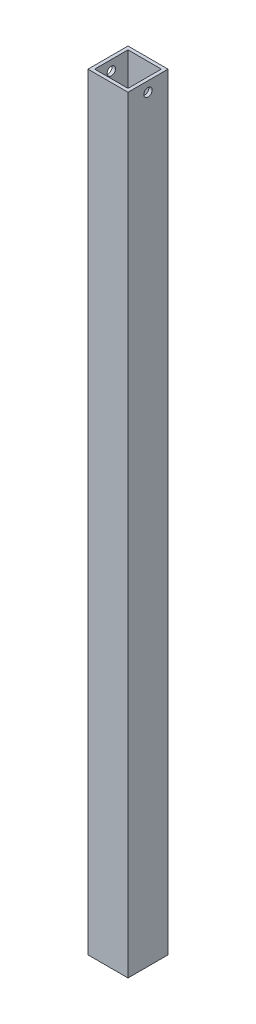
ISO-10303-21;
HEADER;
FILE_DESCRIPTION(('STEP AP214'),'2;1');
FILE_NAME('part.step','',(''),(''),'','','');
FILE_SCHEMA(('AUTOMOTIVE_DESIGN { 1 0 10303 214 1 1 1 1 }'));
ENDSEC;
DATA;
#1=APPLICATION_CONTEXT('core data for automotive mechanical design processes');
#2=APPLICATION_PROTOCOL_DEFINITION('international standard','automotive_design',2000,#1);
#3=PRODUCT_CONTEXT('',#1,'mechanical');
#4=PRODUCT('Part','Part','',(#3));
#5=PRODUCT_RELATED_PRODUCT_CATEGORY('part','',(#4));
#6=PRODUCT_DEFINITION_FORMATION('','',#4);
#7=PRODUCT_DEFINITION_CONTEXT('part definition',#1,'design');
#8=PRODUCT_DEFINITION('design','',#6,#7);
#9=PRODUCT_DEFINITION_SHAPE('','',#8);
#10=(LENGTH_UNIT() NAMED_UNIT(*) SI_UNIT(.MILLI.,.METRE.));
#11=(NAMED_UNIT(*) PLANE_ANGLE_UNIT() SI_UNIT($,.RADIAN.));
#12=(NAMED_UNIT(*) SI_UNIT($,.STERADIAN.) SOLID_ANGLE_UNIT());
#13=UNCERTAINTY_MEASURE_WITH_UNIT(LENGTH_MEASURE(1.E-05),#10,'distance_accuracy_value','');
#14=(GEOMETRIC_REPRESENTATION_CONTEXT(3) GLOBAL_UNCERTAINTY_ASSIGNED_CONTEXT((#13)) GLOBAL_UNIT_ASSIGNED_CONTEXT((#10,
#11,#12)) REPRESENTATION_CONTEXT('',''));
#15=CARTESIAN_POINT('',(0.,0.,0.));
#16=DIRECTION('',(0.,0.,1.));
#17=DIRECTION('',(1.,0.,0.));
#18=AXIS2_PLACEMENT_3D('',#15,#16,#17);
#19=CARTESIAN_POINT('',(0.,0.,-38.1));
#20=DIRECTION('',(-1.,0.,0.));
#21=DIRECTION('',(0.,-1.,0.));
#22=AXIS2_PLACEMENT_3D('',#19,#20,#21);
#23=PLANE('',#22);
#24=CARTESIAN_POINT('',(0.,720.725,-19.05));
#25=DIRECTION('',(-1.,0.,0.));
#26=DIRECTION('',(0.,0.,1.));
#27=AXIS2_PLACEMENT_3D('',#24,#25,#26);
#28=CIRCLE('',#27,3.96874999999997);
#29=CARTESIAN_POINT('',(0.,720.725,-15.08125));
#30=VERTEX_POINT('',#29);
#31=EDGE_CURVE('E172',#30,#30,#28,.T.);
#32=ORIENTED_EDGE('',*,*,#31,.T.);
#33=EDGE_LOOP('',(#32));
#34=FACE_BOUND('',#33,.T.);
#35=DIRECTION('',(0.,1.,0.));
#36=VECTOR('',#35,1.);
#37=CARTESIAN_POINT('',(0.,0.,-38.1));
#38=LINE('',#37,#36);
#39=CARTESIAN_POINT('',(0.,0.,-38.1));
#40=VERTEX_POINT('',#39);
#41=CARTESIAN_POINT('',(0.,730.25,-38.1));
#42=VERTEX_POINT('',#41);
#43=EDGE_CURVE('E115',#40,#42,#38,.T.);
#44=ORIENTED_EDGE('',*,*,#43,.T.);
#45=DIRECTION('',(0.,0.,1.));
#46=VECTOR('',#45,1.);
#47=CARTESIAN_POINT('',(0.,730.25,-38.1));
#48=LINE('',#47,#46);
#49=CARTESIAN_POINT('',(0.,730.25,0.));
#50=VERTEX_POINT('',#49);
#51=EDGE_CURVE('E47',#42,#50,#48,.T.);
#52=ORIENTED_EDGE('',*,*,#51,.T.);
#53=DIRECTION('',(0.,1.,0.));
#54=VECTOR('',#53,1.);
#55=CARTESIAN_POINT('',(0.,0.,0.));
#56=LINE('',#55,#54);
#57=CARTESIAN_POINT('',(0.,0.,0.));
#58=VERTEX_POINT('',#57);
#59=EDGE_CURVE('E117',#58,#50,#56,.T.);
#60=ORIENTED_EDGE('',*,*,#59,.F.);
#61=DIRECTION('',(0.,0.,1.));
#62=VECTOR('',#61,1.);
#63=CARTESIAN_POINT('',(0.,0.,-38.1));
#64=LINE('',#63,#62);
#65=EDGE_CURVE('E119',#40,#58,#64,.T.);
#66=ORIENTED_EDGE('',*,*,#65,.F.);
#67=EDGE_LOOP('',(#44,#52,#60,#66));
#68=FACE_BOUND('',#67,.T.);
#69=ADVANCED_FACE('F33',(#34,#68),#23,.F.);
#70=CARTESIAN_POINT('',(-38.1,0.,0.));
#71=DIRECTION('',(0.,0.,-1.));
#72=DIRECTION('',(-1.,0.,0.));
#73=AXIS2_PLACEMENT_3D('',#70,#71,#72);
#74=PLANE('',#73);
#75=ORIENTED_EDGE('',*,*,#59,.T.);
#76=DIRECTION('',(1.,0.,0.));
#77=VECTOR('',#76,1.);
#78=CARTESIAN_POINT('',(-38.1,730.25,0.));
#79=LINE('',#78,#77);
#80=CARTESIAN_POINT('',(-38.1,730.25,0.));
#81=VERTEX_POINT('',#80);
#82=EDGE_CURVE('E101',#81,#50,#79,.T.);
#83=ORIENTED_EDGE('',*,*,#82,.F.);
#84=DIRECTION('',(0.,1.,0.));
#85=VECTOR('',#84,1.);
#86=CARTESIAN_POINT('',(-38.1,0.,0.));
#87=LINE('',#86,#85);
#88=CARTESIAN_POINT('',(-38.1,0.,0.));
#89=VERTEX_POINT('',#88);
#90=EDGE_CURVE('E109',#89,#81,#87,.T.);
#91=ORIENTED_EDGE('',*,*,#90,.F.);
#92=DIRECTION('',(-1.,0.,0.));
#93=VECTOR('',#92,1.);
#94=CARTESIAN_POINT('',(-38.1,0.,0.));
#95=LINE('',#94,#93);
#96=EDGE_CURVE('E145',#58,#89,#95,.T.);
#97=ORIENTED_EDGE('',*,*,#96,.F.);
#98=EDGE_LOOP('',(#75,#83,#91,#97));
#99=FACE_BOUND('',#98,.T.);
#100=ADVANCED_FACE('F182',(#99),#74,.F.);
#101=CARTESIAN_POINT('',(-38.1,0.,-38.1));
#102=DIRECTION('',(1.,0.,0.));
#103=DIRECTION('',(0.,1.,0.));
#104=AXIS2_PLACEMENT_3D('',#101,#102,#103);
#105=PLANE('',#104);
#106=CARTESIAN_POINT('',(-38.1,720.725,-19.05));
#107=DIRECTION('',(-1.,0.,0.));
#108=DIRECTION('',(0.,0.,1.));
#109=AXIS2_PLACEMENT_3D('',#106,#107,#108);
#110=CIRCLE('',#109,3.96874999999997);
#111=CARTESIAN_POINT('',(-38.1,720.725,-15.08125));
#112=VERTEX_POINT('',#111);
#113=EDGE_CURVE('E175',#112,#112,#110,.T.);
#114=ORIENTED_EDGE('',*,*,#113,.F.);
#115=EDGE_LOOP('',(#114));
#116=FACE_BOUND('',#115,.T.);
#117=ORIENTED_EDGE('',*,*,#90,.T.);
#118=DIRECTION('',(0.,0.,1.));
#119=VECTOR('',#118,1.);
#120=CARTESIAN_POINT('',(-38.1,730.25,-38.1));
#121=LINE('',#120,#119);
#122=CARTESIAN_POINT('',(-38.1,730.25,-38.1));
#123=VERTEX_POINT('',#122);
#124=EDGE_CURVE('E96',#123,#81,#121,.T.);
#125=ORIENTED_EDGE('',*,*,#124,.F.);
#126=DIRECTION('',(0.,1.,0.));
#127=VECTOR('',#126,1.);
#128=CARTESIAN_POINT('',(-38.1,0.,-38.1));
#129=LINE('',#128,#127);
#130=CARTESIAN_POINT('',(-38.1,0.,-38.1));
#131=VERTEX_POINT('',#130);
#132=EDGE_CURVE('E106',#131,#123,#129,.T.);
#133=ORIENTED_EDGE('',*,*,#132,.F.);
#134=DIRECTION('',(0.,0.,-1.));
#135=VECTOR('',#134,1.);
#136=CARTESIAN_POINT('',(-38.1,0.,-38.1));
#137=LINE('',#136,#135);
#138=EDGE_CURVE('E148',#89,#131,#137,.T.);
#139=ORIENTED_EDGE('',*,*,#138,.F.);
#140=EDGE_LOOP('',(#117,#125,#133,#139));
#141=FACE_BOUND('',#140,.T.);
#142=ADVANCED_FACE('F105',(#116,#141),#105,.F.);
#143=CARTESIAN_POINT('',(-38.1,0.,-38.1));
#144=DIRECTION('',(0.,0.,1.));
#145=DIRECTION('',(1.,0.,0.));
#146=AXIS2_PLACEMENT_3D('',#143,#144,#145);
#147=PLANE('',#146);
#148=ORIENTED_EDGE('',*,*,#132,.T.);
#149=DIRECTION('',(1.,0.,0.));
#150=VECTOR('',#149,1.);
#151=CARTESIAN_POINT('',(-38.1,730.25,-38.1));
#152=LINE('',#151,#150);
#153=EDGE_CURVE('E93',#123,#42,#152,.T.);
#154=ORIENTED_EDGE('',*,*,#153,.T.);
#155=ORIENTED_EDGE('',*,*,#43,.F.);
#156=DIRECTION('',(1.,0.,0.));
#157=VECTOR('',#156,1.);
#158=CARTESIAN_POINT('',(-38.1,0.,-38.1));
#159=LINE('',#158,#157);
#160=EDGE_CURVE('E113',#131,#40,#159,.T.);
#161=ORIENTED_EDGE('',*,*,#160,.F.);
#162=EDGE_LOOP('',(#148,#154,#155,#161));
#163=FACE_BOUND('',#162,.T.);
#164=ADVANCED_FACE('F111',(#163),#147,.F.);
#165=CARTESIAN_POINT('',(0.,0.,-38.1));
#166=DIRECTION('',(0.,-1.,0.));
#167=DIRECTION('',(1.,0.,0.));
#168=AXIS2_PLACEMENT_3D('',#165,#166,#167);
#169=PLANE('',#168);
#170=DIRECTION('',(0.,0.,1.));
#171=VECTOR('',#170,1.);
#172=CARTESIAN_POINT('',(-3.175,0.,-34.925));
#173=LINE('',#172,#171);
#174=CARTESIAN_POINT('',(-3.175,0.,-34.925));
#175=VERTEX_POINT('',#174);
#176=CARTESIAN_POINT('',(-3.175,0.,-3.175));
#177=VERTEX_POINT('',#176);
#178=EDGE_CURVE('E151',#175,#177,#173,.T.);
#179=ORIENTED_EDGE('',*,*,#178,.F.);
#180=DIRECTION('',(1.,0.,0.));
#181=VECTOR('',#180,1.);
#182=CARTESIAN_POINT('',(-34.925,0.,-34.925));
#183=LINE('',#182,#181);
#184=CARTESIAN_POINT('',(-34.925,0.,-34.925));
#185=VERTEX_POINT('',#184);
#186=EDGE_CURVE('E154',#185,#175,#183,.T.);
#187=ORIENTED_EDGE('',*,*,#186,.F.);
#188=DIRECTION('',(0.,0.,-1.));
#189=VECTOR('',#188,1.);
#190=CARTESIAN_POINT('',(-34.925,0.,-34.925));
#191=LINE('',#190,#189);
#192=CARTESIAN_POINT('',(-34.925,0.,-3.175));
#193=VERTEX_POINT('',#192);
#194=EDGE_CURVE('E156',#193,#185,#191,.T.);
#195=ORIENTED_EDGE('',*,*,#194,.F.);
#196=DIRECTION('',(-1.,0.,0.));
#197=VECTOR('',#196,1.);
#198=CARTESIAN_POINT('',(-34.925,0.,-3.175));
#199=LINE('',#198,#197);
#200=EDGE_CURVE('E40',#177,#193,#199,.T.);
#201=ORIENTED_EDGE('',*,*,#200,.F.);
#202=EDGE_LOOP('',(#179,#187,#195,#201));
#203=FACE_BOUND('',#202,.T.);
#204=ORIENTED_EDGE('',*,*,#160,.T.);
#205=ORIENTED_EDGE('',*,*,#65,.T.);
#206=ORIENTED_EDGE('',*,*,#96,.T.);
#207=ORIENTED_EDGE('',*,*,#138,.T.);
#208=EDGE_LOOP('',(#204,#205,#206,#207));
#209=FACE_BOUND('',#208,.T.);
#210=ADVANCED_FACE('F188',(#203,#209),#169,.T.);
#211=CARTESIAN_POINT('',(-3.175,0.,-34.925));
#212=DIRECTION('',(-1.,0.,0.));
#213=DIRECTION('',(0.,-1.,0.));
#214=AXIS2_PLACEMENT_3D('',#211,#212,#213);
#215=PLANE('',#214);
#216=CARTESIAN_POINT('',(-3.175,720.725,-19.05));
#217=DIRECTION('',(-1.,0.,0.));
#218=DIRECTION('',(0.,-1.,0.));
#219=AXIS2_PLACEMENT_3D('',#216,#217,#218);
#220=CIRCLE('',#219,3.96874999999997);
#221=CARTESIAN_POINT('',(-3.175,716.75625,-19.05));
#222=VERTEX_POINT('',#221);
#223=EDGE_CURVE('E169',#222,#222,#220,.T.);
#224=ORIENTED_EDGE('',*,*,#223,.F.);
#225=EDGE_LOOP('',(#224));
#226=FACE_BOUND('',#225,.T.);
#227=DIRECTION('',(0.,0.,1.));
#228=VECTOR('',#227,1.);
#229=CARTESIAN_POINT('',(-3.175,730.25,-34.925));
#230=LINE('',#229,#228);
#231=CARTESIAN_POINT('',(-3.175,730.25,-34.925));
#232=VERTEX_POINT('',#231);
#233=CARTESIAN_POINT('',(-3.175,730.25,-3.175));
#234=VERTEX_POINT('',#233);
#235=EDGE_CURVE('E54',#232,#234,#230,.T.);
#236=ORIENTED_EDGE('',*,*,#235,.F.);
#237=DIRECTION('',(0.,1.,0.));
#238=VECTOR('',#237,1.);
#239=CARTESIAN_POINT('',(-3.175,0.,-34.925));
#240=LINE('',#239,#238);
#241=EDGE_CURVE('E126',#175,#232,#240,.T.);
#242=ORIENTED_EDGE('',*,*,#241,.F.);
#243=ORIENTED_EDGE('',*,*,#178,.T.);
#244=DIRECTION('',(0.,1.,0.));
#245=VECTOR('',#244,1.);
#246=CARTESIAN_POINT('',(-3.175,0.,-3.175));
#247=LINE('',#246,#245);
#248=EDGE_CURVE('E124',#177,#234,#247,.T.);
#249=ORIENTED_EDGE('',*,*,#248,.T.);
#250=EDGE_LOOP('',(#236,#242,#243,#249));
#251=FACE_BOUND('',#250,.T.);
#252=ADVANCED_FACE('F201',(#226,#251),#215,.T.);
#253=CARTESIAN_POINT('',(-34.925,0.,-34.925));
#254=DIRECTION('',(0.,0.,1.));
#255=DIRECTION('',(1.,0.,0.));
#256=AXIS2_PLACEMENT_3D('',#253,#254,#255);
#257=PLANE('',#256);
#258=DIRECTION('',(1.,0.,0.));
#259=VECTOR('',#258,1.);
#260=CARTESIAN_POINT('',(-34.925,730.25,-34.925));
#261=LINE('',#260,#259);
#262=CARTESIAN_POINT('',(-34.925,730.25,-34.925));
#263=VERTEX_POINT('',#262);
#264=EDGE_CURVE('E160',#263,#232,#261,.T.);
#265=ORIENTED_EDGE('',*,*,#264,.F.);
#266=DIRECTION('',(0.,1.,0.));
#267=VECTOR('',#266,1.);
#268=CARTESIAN_POINT('',(-34.925,0.,-34.925));
#269=LINE('',#268,#267);
#270=EDGE_CURVE('E131',#185,#263,#269,.T.);
#271=ORIENTED_EDGE('',*,*,#270,.F.);
#272=ORIENTED_EDGE('',*,*,#186,.T.);
#273=ORIENTED_EDGE('',*,*,#241,.T.);
#274=EDGE_LOOP('',(#265,#271,#272,#273));
#275=FACE_BOUND('',#274,.T.);
#276=ADVANCED_FACE('F207',(#275),#257,.T.);
#277=CARTESIAN_POINT('',(-34.925,0.,-34.925));
#278=DIRECTION('',(1.,0.,0.));
#279=DIRECTION('',(0.,1.,0.));
#280=AXIS2_PLACEMENT_3D('',#277,#278,#279);
#281=PLANE('',#280);
#282=CARTESIAN_POINT('',(-34.925,720.725,-19.05));
#283=DIRECTION('',(1.,0.,0.));
#284=DIRECTION('',(0.,1.,0.));
#285=AXIS2_PLACEMENT_3D('',#282,#283,#284);
#286=CIRCLE('',#285,3.96874999999997);
#287=CARTESIAN_POINT('',(-34.925,724.69375,-19.05));
#288=VERTEX_POINT('',#287);
#289=EDGE_CURVE('E165',#288,#288,#286,.T.);
#290=ORIENTED_EDGE('',*,*,#289,.F.);
#291=EDGE_LOOP('',(#290));
#292=FACE_BOUND('',#291,.T.);
#293=DIRECTION('',(0.,0.,-1.));
#294=VECTOR('',#293,1.);
#295=CARTESIAN_POINT('',(-34.925,730.25,-34.925));
#296=LINE('',#295,#294);
#297=CARTESIAN_POINT('',(-34.925,730.25,-3.175));
#298=VERTEX_POINT('',#297);
#299=EDGE_CURVE('E162',#298,#263,#296,.T.);
#300=ORIENTED_EDGE('',*,*,#299,.F.);
#301=DIRECTION('',(0.,1.,0.));
#302=VECTOR('',#301,1.);
#303=CARTESIAN_POINT('',(-34.925,0.,-3.175));
#304=LINE('',#303,#302);
#305=EDGE_CURVE('E137',#193,#298,#304,.T.);
#306=ORIENTED_EDGE('',*,*,#305,.F.);
#307=ORIENTED_EDGE('',*,*,#194,.T.);
#308=ORIENTED_EDGE('',*,*,#270,.T.);
#309=EDGE_LOOP('',(#300,#306,#307,#308));
#310=FACE_BOUND('',#309,.T.);
#311=ADVANCED_FACE('F216',(#292,#310),#281,.T.);
#312=CARTESIAN_POINT('',(-34.925,0.,-3.175));
#313=DIRECTION('',(0.,0.,-1.));
#314=DIRECTION('',(-1.,0.,0.));
#315=AXIS2_PLACEMENT_3D('',#312,#313,#314);
#316=PLANE('',#315);
#317=DIRECTION('',(-1.,0.,0.));
#318=VECTOR('',#317,1.);
#319=CARTESIAN_POINT('',(-34.925,730.25,-3.175));
#320=LINE('',#319,#318);
#321=EDGE_CURVE('E11',#234,#298,#320,.T.);
#322=ORIENTED_EDGE('',*,*,#321,.F.);
#323=ORIENTED_EDGE('',*,*,#248,.F.);
#324=ORIENTED_EDGE('',*,*,#200,.T.);
#325=ORIENTED_EDGE('',*,*,#305,.T.);
#326=EDGE_LOOP('',(#322,#323,#324,#325));
#327=FACE_BOUND('',#326,.T.);
#328=ADVANCED_FACE('F213',(#327),#316,.T.);
#329=CARTESIAN_POINT('',(-38.1,730.25,-38.1));
#330=DIRECTION('',(0.,-1.,0.));
#331=DIRECTION('',(0.,0.,-1.));
#332=AXIS2_PLACEMENT_3D('',#329,#330,#331);
#333=PLANE('',#332);
#334=ORIENTED_EDGE('',*,*,#235,.T.);
#335=ORIENTED_EDGE('',*,*,#321,.T.);
#336=ORIENTED_EDGE('',*,*,#299,.T.);
#337=ORIENTED_EDGE('',*,*,#264,.T.);
#338=EDGE_LOOP('',(#334,#335,#336,#337));
#339=FACE_BOUND('',#338,.T.);
#340=ORIENTED_EDGE('',*,*,#82,.T.);
#341=ORIENTED_EDGE('',*,*,#51,.F.);
#342=ORIENTED_EDGE('',*,*,#153,.F.);
#343=ORIENTED_EDGE('',*,*,#124,.T.);
#344=EDGE_LOOP('',(#340,#341,#342,#343));
#345=FACE_BOUND('',#344,.T.);
#346=ADVANCED_FACE('F95',(#339,#345),#333,.F.);
#347=CARTESIAN_POINT('',(-38.1,720.725,-19.05));
#348=DIRECTION('',(-1.,0.,0.));
#349=DIRECTION('',(0.,0.,1.));
#350=AXIS2_PLACEMENT_3D('',#347,#348,#349);
#351=CYLINDRICAL_SURFACE('',#350,3.96874999999997);
#352=ORIENTED_EDGE('',*,*,#223,.T.);
#353=EDGE_LOOP('',(#352));
#354=FACE_BOUND('',#353,.T.);
#355=ORIENTED_EDGE('',*,*,#31,.F.);
#356=EDGE_LOOP('',(#355));
#357=FACE_BOUND('',#356,.T.);
#358=ADVANCED_FACE('F229',(#354,#357),#351,.F.);
#359=ORIENTED_EDGE('',*,*,#289,.T.);
#360=EDGE_LOOP('',(#359));
#361=FACE_BOUND('',#360,.T.);
#362=ORIENTED_EDGE('',*,*,#113,.T.);
#363=EDGE_LOOP('',(#362));
#364=FACE_BOUND('',#363,.T.);
#365=ADVANCED_FACE('F179',(#361,#364),#351,.F.);
#366=CLOSED_SHELL('',(#69,#100,#142,#164,#210,#252,#276,#311,#328,#346,#358,#365));
#367=MANIFOLD_SOLID_BREP('B2',#366);
#368=ADVANCED_BREP_SHAPE_REPRESENTATION('',(#18,#367),#14);
#369=SHAPE_DEFINITION_REPRESENTATION(#9,#368);
ENDSEC;
END-ISO-10303-21;
